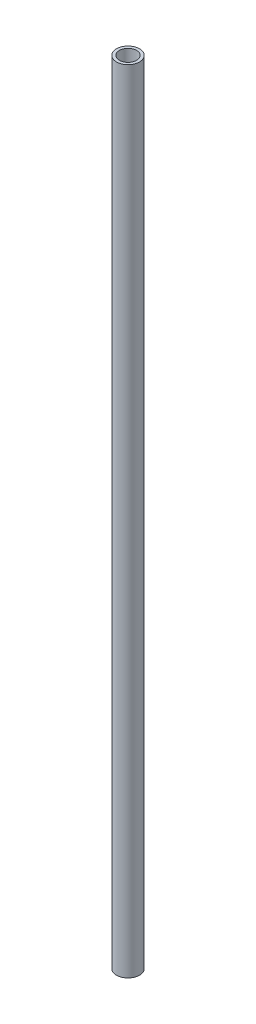
ISO-10303-21;
HEADER;
FILE_DESCRIPTION(('STEP AP214'),'2;1');
FILE_NAME('part.step','',(''),(''),'','','');
FILE_SCHEMA(('AUTOMOTIVE_DESIGN { 1 0 10303 214 1 1 1 1 }'));
ENDSEC;
DATA;
#1=APPLICATION_CONTEXT('core data for automotive mechanical design processes');
#2=APPLICATION_PROTOCOL_DEFINITION('international standard','automotive_design',2000,#1);
#3=PRODUCT_CONTEXT('',#1,'mechanical');
#4=PRODUCT('Part','Part','',(#3));
#5=PRODUCT_RELATED_PRODUCT_CATEGORY('part','',(#4));
#6=PRODUCT_DEFINITION_FORMATION('','',#4);
#7=PRODUCT_DEFINITION_CONTEXT('part definition',#1,'design');
#8=PRODUCT_DEFINITION('design','',#6,#7);
#9=PRODUCT_DEFINITION_SHAPE('','',#8);
#10=(LENGTH_UNIT() NAMED_UNIT(*) SI_UNIT(.MILLI.,.METRE.));
#11=(NAMED_UNIT(*) PLANE_ANGLE_UNIT() SI_UNIT($,.RADIAN.));
#12=(NAMED_UNIT(*) SI_UNIT($,.STERADIAN.) SOLID_ANGLE_UNIT());
#13=UNCERTAINTY_MEASURE_WITH_UNIT(LENGTH_MEASURE(1.E-05),#10,'distance_accuracy_value','');
#14=(GEOMETRIC_REPRESENTATION_CONTEXT(3) GLOBAL_UNCERTAINTY_ASSIGNED_CONTEXT((#13)) GLOBAL_UNIT_ASSIGNED_CONTEXT((#10,
#11,#12)) REPRESENTATION_CONTEXT('',''));
#15=CARTESIAN_POINT('',(0.,0.,0.));
#16=DIRECTION('',(0.,0.,1.));
#17=DIRECTION('',(1.,0.,0.));
#18=AXIS2_PLACEMENT_3D('',#15,#16,#17);
#19=CARTESIAN_POINT('',(0.,438.15,0.));
#20=DIRECTION('',(0.,1.,0.));
#21=DIRECTION('',(0.,0.,1.));
#22=AXIS2_PLACEMENT_3D('',#19,#20,#21);
#23=PLANE('',#22);
#24=CARTESIAN_POINT('',(0.,438.15,0.));
#25=DIRECTION('',(0.,1.,0.));
#26=DIRECTION('',(0.,0.,1.));
#27=AXIS2_PLACEMENT_3D('',#24,#25,#26);
#28=CIRCLE('',#27,12.7);
#29=CARTESIAN_POINT('',(0.,438.15,12.7));
#30=VERTEX_POINT('',#29);
#31=EDGE_CURVE('E10',#30,#30,#28,.T.);
#32=ORIENTED_EDGE('',*,*,#31,.T.);
#33=EDGE_LOOP('',(#32));
#34=FACE_BOUND('',#33,.T.);
#35=CARTESIAN_POINT('',(0.,438.15,0.));
#36=DIRECTION('',(0.,1.,0.));
#37=DIRECTION('',(0.,0.,1.));
#38=AXIS2_PLACEMENT_3D('',#35,#36,#37);
#39=CIRCLE('',#38,9.52500000000001);
#40=CARTESIAN_POINT('',(0.,438.15,9.52500000000001));
#41=VERTEX_POINT('',#40);
#42=EDGE_CURVE('E49',#41,#41,#39,.T.);
#43=ORIENTED_EDGE('',*,*,#42,.F.);
#44=EDGE_LOOP('',(#43));
#45=FACE_BOUND('',#44,.T.);
#46=ADVANCED_FACE('F38',(#34,#45),#23,.T.);
#47=CARTESIAN_POINT('',(0.,-438.15,0.));
#48=DIRECTION('',(0.,1.,0.));
#49=DIRECTION('',(0.,0.,1.));
#50=AXIS2_PLACEMENT_3D('',#47,#48,#49);
#51=PLANE('',#50);
#52=CARTESIAN_POINT('',(0.,-438.15,0.));
#53=DIRECTION('',(0.,1.,0.));
#54=DIRECTION('',(0.,0.,1.));
#55=AXIS2_PLACEMENT_3D('',#52,#53,#54);
#56=CIRCLE('',#55,12.7);
#57=CARTESIAN_POINT('',(0.,-438.15,12.7));
#58=VERTEX_POINT('',#57);
#59=EDGE_CURVE('E42',#58,#58,#56,.T.);
#60=ORIENTED_EDGE('',*,*,#59,.F.);
#61=EDGE_LOOP('',(#60));
#62=FACE_BOUND('',#61,.T.);
#63=CARTESIAN_POINT('',(0.,-438.15,0.));
#64=DIRECTION('',(0.,1.,0.));
#65=DIRECTION('',(0.,0.,1.));
#66=AXIS2_PLACEMENT_3D('',#63,#64,#65);
#67=CIRCLE('',#66,9.52500000000001);
#68=CARTESIAN_POINT('',(0.,-438.15,9.52500000000001));
#69=VERTEX_POINT('',#68);
#70=EDGE_CURVE('E51',#69,#69,#67,.T.);
#71=ORIENTED_EDGE('',*,*,#70,.T.);
#72=EDGE_LOOP('',(#71));
#73=FACE_BOUND('',#72,.T.);
#74=ADVANCED_FACE('F61',(#62,#73),#51,.F.);
#75=CARTESIAN_POINT('',(0.,438.15,0.));
#76=DIRECTION('',(0.,-1.,0.));
#77=DIRECTION('',(0.,0.,-1.));
#78=AXIS2_PLACEMENT_3D('',#75,#76,#77);
#79=CYLINDRICAL_SURFACE('',#78,12.7);
#80=ORIENTED_EDGE('',*,*,#31,.F.);
#81=EDGE_LOOP('',(#80));
#82=FACE_BOUND('',#81,.T.);
#83=ORIENTED_EDGE('',*,*,#59,.T.);
#84=EDGE_LOOP('',(#83));
#85=FACE_BOUND('',#84,.T.);
#86=ADVANCED_FACE('F40',(#82,#85),#79,.T.);
#87=CARTESIAN_POINT('',(0.,438.15,0.));
#88=DIRECTION('',(0.,-1.,0.));
#89=DIRECTION('',(0.,0.,-1.));
#90=AXIS2_PLACEMENT_3D('',#87,#88,#89);
#91=CYLINDRICAL_SURFACE('',#90,9.52500000000001);
#92=ORIENTED_EDGE('',*,*,#42,.T.);
#93=EDGE_LOOP('',(#92));
#94=FACE_BOUND('',#93,.T.);
#95=ORIENTED_EDGE('',*,*,#70,.F.);
#96=EDGE_LOOP('',(#95));
#97=FACE_BOUND('',#96,.T.);
#98=ADVANCED_FACE('F57',(#94,#97),#91,.F.);
#99=CLOSED_SHELL('',(#46,#74,#86,#98));
#100=MANIFOLD_SOLID_BREP('B2',#99);
#101=ADVANCED_BREP_SHAPE_REPRESENTATION('',(#18,#100),#14);
#102=SHAPE_DEFINITION_REPRESENTATION(#9,#101);
ENDSEC;
END-ISO-10303-21;
